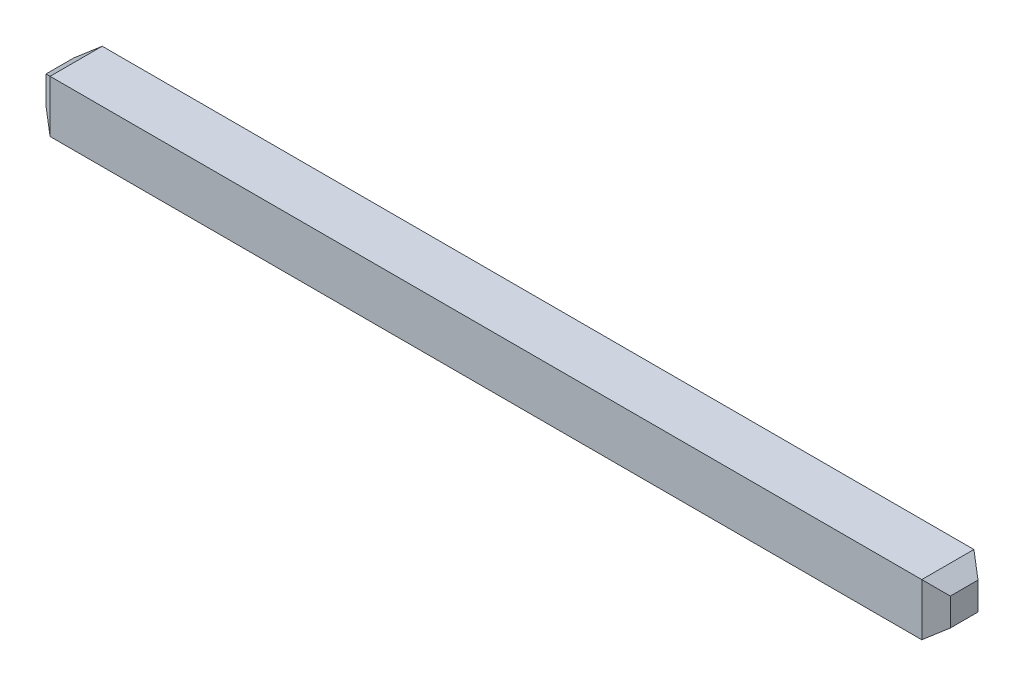
ISO-10303-21;
HEADER;
FILE_DESCRIPTION(('STEP AP214'),'2;1');
FILE_NAME('part.step','',(''),(''),'','','');
FILE_SCHEMA(('AUTOMOTIVE_DESIGN { 1 0 10303 214 1 1 1 1 }'));
ENDSEC;
DATA;
#1=APPLICATION_CONTEXT('core data for automotive mechanical design processes');
#2=APPLICATION_PROTOCOL_DEFINITION('international standard','automotive_design',2000,#1);
#3=PRODUCT_CONTEXT('',#1,'mechanical');
#4=PRODUCT('Part','Part','',(#3));
#5=PRODUCT_RELATED_PRODUCT_CATEGORY('part','',(#4));
#6=PRODUCT_DEFINITION_FORMATION('','',#4);
#7=PRODUCT_DEFINITION_CONTEXT('part definition',#1,'design');
#8=PRODUCT_DEFINITION('design','',#6,#7);
#9=PRODUCT_DEFINITION_SHAPE('','',#8);
#10=(LENGTH_UNIT() NAMED_UNIT(*) SI_UNIT(.MILLI.,.METRE.));
#11=(NAMED_UNIT(*) PLANE_ANGLE_UNIT() SI_UNIT($,.RADIAN.));
#12=(NAMED_UNIT(*) SI_UNIT($,.STERADIAN.) SOLID_ANGLE_UNIT());
#13=UNCERTAINTY_MEASURE_WITH_UNIT(LENGTH_MEASURE(1.E-05),#10,'distance_accuracy_value','');
#14=(GEOMETRIC_REPRESENTATION_CONTEXT(3) GLOBAL_UNCERTAINTY_ASSIGNED_CONTEXT((#13)) GLOBAL_UNIT_ASSIGNED_CONTEXT((#10,
#11,#12)) REPRESENTATION_CONTEXT('',''));
#15=CARTESIAN_POINT('',(0.,0.,0.));
#16=DIRECTION('',(0.,0.,1.));
#17=DIRECTION('',(1.,0.,0.));
#18=AXIS2_PLACEMENT_3D('',#15,#16,#17);
#19=CARTESIAN_POINT('',(-2.4,3.525,-31.75));
#20=DIRECTION('',(0.6,0.8,0.));
#21=DIRECTION('',(-0.8,0.6,0.));
#22=AXIS2_PLACEMENT_3D('',#19,#20,#21);
#23=PLANE('',#22);
#24=DIRECTION('',(0.,0.,1.));
#25=VECTOR('',#24,1.);
#26=CARTESIAN_POINT('',(-2.3,3.45,-31.75));
#27=LINE('',#26,#25);
#28=CARTESIAN_POINT('',(-2.29999999999978,3.45,-32.0699999999997));
#29=VERTEX_POINT('',#28);
#30=CARTESIAN_POINT('',(-2.29999999999978,3.45,-31.4300000000003));
#31=VERTEX_POINT('',#30);
#32=EDGE_CURVE('E105',#29,#31,#27,.T.);
#33=ORIENTED_EDGE('',*,*,#32,.T.);
#34=DIRECTION('',(0.685994340575952,-0.514495755427537,0.514495755419627));
#35=VECTOR('',#34,1.);
#36=CARTESIAN_POINT('',(-2.50000000000086,3.6,-31.5799999999988));
#37=LINE('',#36,#35);
#38=CARTESIAN_POINT('',(-2.50000000000021,3.6,-31.5799999999997));
#39=VERTEX_POINT('',#38);
#40=EDGE_CURVE('E92',#39,#31,#37,.T.);
#41=ORIENTED_EDGE('',*,*,#40,.F.);
#42=DIRECTION('',(0.,0.,-1.));
#43=VECTOR('',#42,1.);
#44=CARTESIAN_POINT('',(-2.5,3.6,-31.75));
#45=LINE('',#44,#43);
#46=CARTESIAN_POINT('',(-2.50000000000043,3.6,-31.9200000000006));
#47=VERTEX_POINT('',#46);
#48=EDGE_CURVE('E79',#39,#47,#45,.T.);
#49=ORIENTED_EDGE('',*,*,#48,.T.);
#50=DIRECTION('',(0.685994340575993,-0.514495755427534,-0.514495755419576));
#51=VECTOR('',#50,1.);
#52=CARTESIAN_POINT('',(-2.50000000000087,3.6,-31.9200000000012));
#53=LINE('',#52,#51);
#54=EDGE_CURVE('E20',#47,#29,#53,.T.);
#55=ORIENTED_EDGE('',*,*,#54,.T.);
#56=EDGE_LOOP('',(#33,#41,#49,#55));
#57=FACE_BOUND('',#56,.T.);
#58=ADVANCED_FACE('F17',(#57),#23,.F.);
#59=CARTESIAN_POINT('',(8.5,3.525,-31.75));
#60=DIRECTION('',(-0.6,0.8,0.));
#61=DIRECTION('',(-0.8,-0.6,0.));
#62=AXIS2_PLACEMENT_3D('',#59,#60,#61);
#63=PLANE('',#62);
#64=DIRECTION('',(0.,0.,-1.));
#65=VECTOR('',#64,1.);
#66=CARTESIAN_POINT('',(8.6,3.6,-31.75));
#67=LINE('',#66,#65);
#68=CARTESIAN_POINT('',(8.60000000000043,3.6,-31.5799999999994));
#69=VERTEX_POINT('',#68);
#70=CARTESIAN_POINT('',(8.60000000000022,3.6,-31.9200000000003));
#71=VERTEX_POINT('',#70);
#72=EDGE_CURVE('E114',#69,#71,#67,.T.);
#73=ORIENTED_EDGE('',*,*,#72,.F.);
#74=DIRECTION('',(0.68599434057595,0.514495755427539,-0.514495755419628));
#75=VECTOR('',#74,1.);
#76=CARTESIAN_POINT('',(8.39999999999914,3.45,-31.4300000000012));
#77=LINE('',#76,#75);
#78=CARTESIAN_POINT('',(8.39999999999989,3.45,-31.4300000000001));
#79=VERTEX_POINT('',#78);
#80=EDGE_CURVE('E109',#79,#69,#77,.T.);
#81=ORIENTED_EDGE('',*,*,#80,.F.);
#82=DIRECTION('',(0.,0.,1.));
#83=VECTOR('',#82,1.);
#84=CARTESIAN_POINT('',(8.4,3.45,-31.75));
#85=LINE('',#84,#83);
#86=CARTESIAN_POINT('',(8.39999999999978,3.45,-32.0699999999997));
#87=VERTEX_POINT('',#86);
#88=EDGE_CURVE('E103',#79,#87,#85,.F.);
#89=ORIENTED_EDGE('',*,*,#88,.T.);
#90=DIRECTION('',(0.685994340575992,0.514495755427534,0.514495755419576));
#91=VECTOR('',#90,1.);
#92=CARTESIAN_POINT('',(8.39999999999913,3.45,-32.0699999999988));
#93=LINE('',#92,#91);
#94=EDGE_CURVE('E107',#87,#71,#93,.T.);
#95=ORIENTED_EDGE('',*,*,#94,.T.);
#96=EDGE_LOOP('',(#73,#81,#89,#95));
#97=FACE_BOUND('',#96,.T.);
#98=ADVANCED_FACE('F175',(#97),#63,.F.);
#99=CARTESIAN_POINT('',(-2.4,3.77,-31.995));
#100=DIRECTION('',(0.599999999990736,0.,0.800000000006948));
#101=DIRECTION('',(0.800000000006948,0.,-0.599999999990736));
#102=AXIS2_PLACEMENT_3D('',#99,#100,#101);
#103=PLANE('',#102);
#104=DIRECTION('',(0.,1.,0.));
#105=VECTOR('',#104,1.);
#106=CARTESIAN_POINT('',(-2.3,3.77,-32.07));
#107=LINE('',#106,#105);
#108=CARTESIAN_POINT('',(-2.29999999999957,4.09,-32.0699999999994));
#109=VERTEX_POINT('',#108);
#110=EDGE_CURVE('E88',#109,#29,#107,.F.);
#111=ORIENTED_EDGE('',*,*,#110,.T.);
#112=ORIENTED_EDGE('',*,*,#54,.F.);
#113=DIRECTION('',(0.,1.,0.));
#114=VECTOR('',#113,1.);
#115=CARTESIAN_POINT('',(-2.5,3.77,-31.92));
#116=LINE('',#115,#114);
#117=CARTESIAN_POINT('',(-2.50000000000043,3.94,-31.9200000000006));
#118=VERTEX_POINT('',#117);
#119=EDGE_CURVE('E85',#47,#118,#116,.T.);
#120=ORIENTED_EDGE('',*,*,#119,.T.);
#121=DIRECTION('',(-0.685994340570039,-0.514495755427529,0.51449575542752));
#122=VECTOR('',#121,1.);
#123=CARTESIAN_POINT('',(-2.3,4.09,-32.07));
#124=LINE('',#123,#122);
#125=EDGE_CURVE('E126',#109,#118,#124,.T.);
#126=ORIENTED_EDGE('',*,*,#125,.F.);
#127=EDGE_LOOP('',(#111,#112,#120,#126));
#128=FACE_BOUND('',#127,.T.);
#129=ADVANCED_FACE('F84',(#128),#103,.F.);
#130=CARTESIAN_POINT('',(-2.5,3.77,-31.75));
#131=DIRECTION('',(1.,0.,0.));
#132=DIRECTION('',(0.,0.,-1.));
#133=AXIS2_PLACEMENT_3D('',#130,#131,#132);
#134=PLANE('',#133);
#135=DIRECTION('',(0.,1.,0.));
#136=VECTOR('',#135,1.);
#137=CARTESIAN_POINT('',(-2.50000000000086,3.77,-31.5799999999988));
#138=LINE('',#137,#136);
#139=CARTESIAN_POINT('',(-2.50000000000021,3.94,-31.5799999999997));
#140=VERTEX_POINT('',#139);
#141=EDGE_CURVE('E94',#140,#39,#138,.F.);
#142=ORIENTED_EDGE('',*,*,#141,.F.);
#143=DIRECTION('',(0.,0.,1.));
#144=VECTOR('',#143,1.);
#145=CARTESIAN_POINT('',(-2.5,3.94,-31.75));
#146=LINE('',#145,#144);
#147=EDGE_CURVE('E98',#118,#140,#146,.T.);
#148=ORIENTED_EDGE('',*,*,#147,.F.);
#149=ORIENTED_EDGE('',*,*,#119,.F.);
#150=ORIENTED_EDGE('',*,*,#48,.F.);
#151=EDGE_LOOP('',(#142,#148,#149,#150));
#152=FACE_BOUND('',#151,.T.);
#153=ADVANCED_FACE('F96',(#152),#134,.F.);
#154=CARTESIAN_POINT('',(-2.4,3.77,-31.505));
#155=DIRECTION('',(-0.5999999999908,0.,0.8000000000069));
#156=DIRECTION('',(0.8000000000069,0.,0.5999999999908));
#157=AXIS2_PLACEMENT_3D('',#154,#155,#156);
#158=PLANE('',#157);
#159=ORIENTED_EDGE('',*,*,#40,.T.);
#160=DIRECTION('',(0.,1.,0.));
#161=VECTOR('',#160,1.);
#162=CARTESIAN_POINT('',(-2.3,3.77,-31.43));
#163=LINE('',#162,#161);
#164=CARTESIAN_POINT('',(-2.29999999999957,4.09,-31.4300000000006));
#165=VERTEX_POINT('',#164);
#166=EDGE_CURVE('E132',#165,#31,#163,.F.);
#167=ORIENTED_EDGE('',*,*,#166,.F.);
#168=DIRECTION('',(0.685994340570039,0.514495755427529,0.51449575542752));
#169=VECTOR('',#168,1.);
#170=CARTESIAN_POINT('',(-2.5,3.94,-31.58));
#171=LINE('',#170,#169);
#172=EDGE_CURVE('E129',#140,#165,#171,.T.);
#173=ORIENTED_EDGE('',*,*,#172,.F.);
#174=ORIENTED_EDGE('',*,*,#141,.T.);
#175=EDGE_LOOP('',(#159,#167,#173,#174));
#176=FACE_BOUND('',#175,.T.);
#177=ADVANCED_FACE('F186',(#176),#158,.T.);
#178=CARTESIAN_POINT('',(3.05,3.45,-31.75));
#179=DIRECTION('',(0.,1.,0.));
#180=DIRECTION('',(0.,0.,1.));
#181=AXIS2_PLACEMENT_3D('',#178,#179,#180);
#182=PLANE('',#181);
#183=ORIENTED_EDGE('',*,*,#32,.F.);
#184=DIRECTION('',(1.,0.,0.));
#185=VECTOR('',#184,1.);
#186=CARTESIAN_POINT('',(3.05,3.45,-32.07));
#187=LINE('',#186,#185);
#188=EDGE_CURVE('E123',#29,#87,#187,.T.);
#189=ORIENTED_EDGE('',*,*,#188,.T.);
#190=ORIENTED_EDGE('',*,*,#88,.F.);
#191=DIRECTION('',(1.,0.,0.));
#192=VECTOR('',#191,1.);
#193=CARTESIAN_POINT('',(3.05,3.45,-31.43));
#194=LINE('',#193,#192);
#195=EDGE_CURVE('E135',#31,#79,#194,.T.);
#196=ORIENTED_EDGE('',*,*,#195,.F.);
#197=EDGE_LOOP('',(#183,#189,#190,#196));
#198=FACE_BOUND('',#197,.T.);
#199=ADVANCED_FACE('F179',(#198),#182,.F.);
#200=CARTESIAN_POINT('',(8.5,3.77,-31.995));
#201=DIRECTION('',(-0.599999999990736,0.,0.800000000006948));
#202=DIRECTION('',(0.800000000006948,0.,0.599999999990736));
#203=AXIS2_PLACEMENT_3D('',#200,#201,#202);
#204=PLANE('',#203);
#205=DIRECTION('',(0.,1.,0.));
#206=VECTOR('',#205,1.);
#207=CARTESIAN_POINT('',(8.6,3.77,-31.92));
#208=LINE('',#207,#206);
#209=CARTESIAN_POINT('',(8.60000000000043,3.94,-31.9200000000006));
#210=VERTEX_POINT('',#209);
#211=EDGE_CURVE('E117',#71,#210,#208,.T.);
#212=ORIENTED_EDGE('',*,*,#211,.F.);
#213=ORIENTED_EDGE('',*,*,#94,.F.);
#214=DIRECTION('',(0.,1.,0.));
#215=VECTOR('',#214,1.);
#216=CARTESIAN_POINT('',(8.4,3.77,-32.07));
#217=LINE('',#216,#215);
#218=CARTESIAN_POINT('',(8.39999999999957,4.09,-32.0699999999994));
#219=VERTEX_POINT('',#218);
#220=EDGE_CURVE('E120',#87,#219,#217,.T.);
#221=ORIENTED_EDGE('',*,*,#220,.T.);
#222=DIRECTION('',(-0.685994340570037,0.514495755427528,-0.514495755427522));
#223=VECTOR('',#222,1.);
#224=CARTESIAN_POINT('',(8.6,3.94,-31.92));
#225=LINE('',#224,#223);
#226=EDGE_CURVE('E140',#210,#219,#225,.T.);
#227=ORIENTED_EDGE('',*,*,#226,.F.);
#228=EDGE_LOOP('',(#212,#213,#221,#227));
#229=FACE_BOUND('',#228,.T.);
#230=ADVANCED_FACE('F167',(#229),#204,.F.);
#231=CARTESIAN_POINT('',(8.5,3.77,-31.505));
#232=DIRECTION('',(0.5999999999908,0.,0.8000000000069));
#233=DIRECTION('',(0.8000000000069,0.,-0.5999999999908));
#234=AXIS2_PLACEMENT_3D('',#231,#232,#233);
#235=PLANE('',#234);
#236=DIRECTION('',(0.685994340570037,-0.514495755427528,-0.514495755427522));
#237=VECTOR('',#236,1.);
#238=CARTESIAN_POINT('',(8.4,4.09,-31.43));
#239=LINE('',#238,#237);
#240=CARTESIAN_POINT('',(8.39999999999957,4.09,-31.4300000000006));
#241=VERTEX_POINT('',#240);
#242=CARTESIAN_POINT('',(8.60000000000043,3.94,-31.5799999999994));
#243=VERTEX_POINT('',#242);
#244=EDGE_CURVE('E35',#241,#243,#239,.T.);
#245=ORIENTED_EDGE('',*,*,#244,.F.);
#246=DIRECTION('',(0.,1.,0.));
#247=VECTOR('',#246,1.);
#248=CARTESIAN_POINT('',(8.4,3.77,-31.43));
#249=LINE('',#248,#247);
#250=EDGE_CURVE('E138',#79,#241,#249,.T.);
#251=ORIENTED_EDGE('',*,*,#250,.F.);
#252=ORIENTED_EDGE('',*,*,#80,.T.);
#253=DIRECTION('',(0.,1.,0.));
#254=VECTOR('',#253,1.);
#255=CARTESIAN_POINT('',(8.6,3.77,-31.58));
#256=LINE('',#255,#254);
#257=EDGE_CURVE('E111',#243,#69,#256,.F.);
#258=ORIENTED_EDGE('',*,*,#257,.F.);
#259=EDGE_LOOP('',(#245,#251,#252,#258));
#260=FACE_BOUND('',#259,.T.);
#261=ADVANCED_FACE('F211',(#260),#235,.T.);
#262=CARTESIAN_POINT('',(8.6,3.77,-31.75));
#263=DIRECTION('',(1.,0.,0.));
#264=DIRECTION('',(0.,0.,-1.));
#265=AXIS2_PLACEMENT_3D('',#262,#263,#264);
#266=PLANE('',#265);
#267=ORIENTED_EDGE('',*,*,#211,.T.);
#268=DIRECTION('',(0.,0.,1.));
#269=VECTOR('',#268,1.);
#270=CARTESIAN_POINT('',(8.6,3.94,-31.75));
#271=LINE('',#270,#269);
#272=EDGE_CURVE('E144',#243,#210,#271,.F.);
#273=ORIENTED_EDGE('',*,*,#272,.F.);
#274=ORIENTED_EDGE('',*,*,#257,.T.);
#275=ORIENTED_EDGE('',*,*,#72,.T.);
#276=EDGE_LOOP('',(#267,#273,#274,#275));
#277=FACE_BOUND('',#276,.T.);
#278=ADVANCED_FACE('F172',(#277),#266,.T.);
#279=CARTESIAN_POINT('',(3.05,3.77,-32.07));
#280=DIRECTION('',(0.,0.,1.));
#281=DIRECTION('',(1.,0.,0.));
#282=AXIS2_PLACEMENT_3D('',#279,#280,#281);
#283=PLANE('',#282);
#284=ORIENTED_EDGE('',*,*,#110,.F.);
#285=DIRECTION('',(1.,0.,0.));
#286=VECTOR('',#285,1.);
#287=CARTESIAN_POINT('',(3.05,4.09,-32.07));
#288=LINE('',#287,#286);
#289=EDGE_CURVE('E147',#219,#109,#288,.F.);
#290=ORIENTED_EDGE('',*,*,#289,.F.);
#291=ORIENTED_EDGE('',*,*,#220,.F.);
#292=ORIENTED_EDGE('',*,*,#188,.F.);
#293=EDGE_LOOP('',(#284,#290,#291,#292));
#294=FACE_BOUND('',#293,.T.);
#295=ADVANCED_FACE('F181',(#294),#283,.F.);
#296=CARTESIAN_POINT('',(-2.4,4.015,-31.75));
#297=DIRECTION('',(-0.6,0.8,0.));
#298=DIRECTION('',(-0.8,-0.6,0.));
#299=AXIS2_PLACEMENT_3D('',#296,#297,#298);
#300=PLANE('',#299);
#301=ORIENTED_EDGE('',*,*,#172,.T.);
#302=DIRECTION('',(0.,0.,1.));
#303=VECTOR('',#302,1.);
#304=CARTESIAN_POINT('',(-2.3,4.09,-31.75));
#305=LINE('',#304,#303);
#306=EDGE_CURVE('E150',#109,#165,#305,.T.);
#307=ORIENTED_EDGE('',*,*,#306,.F.);
#308=ORIENTED_EDGE('',*,*,#125,.T.);
#309=ORIENTED_EDGE('',*,*,#147,.T.);
#310=EDGE_LOOP('',(#301,#307,#308,#309));
#311=FACE_BOUND('',#310,.T.);
#312=ADVANCED_FACE('F183',(#311),#300,.T.);
#313=CARTESIAN_POINT('',(3.05,3.77,-31.43));
#314=DIRECTION('',(0.,0.,1.));
#315=DIRECTION('',(1.,0.,0.));
#316=AXIS2_PLACEMENT_3D('',#313,#314,#315);
#317=PLANE('',#316);
#318=ORIENTED_EDGE('',*,*,#195,.T.);
#319=ORIENTED_EDGE('',*,*,#250,.T.);
#320=DIRECTION('',(1.,0.,0.));
#321=VECTOR('',#320,1.);
#322=CARTESIAN_POINT('',(3.05,4.09,-31.43));
#323=LINE('',#322,#321);
#324=EDGE_CURVE('E26',#165,#241,#323,.T.);
#325=ORIENTED_EDGE('',*,*,#324,.F.);
#326=ORIENTED_EDGE('',*,*,#166,.T.);
#327=EDGE_LOOP('',(#318,#319,#325,#326));
#328=FACE_BOUND('',#327,.T.);
#329=ADVANCED_FACE('F160',(#328),#317,.T.);
#330=CARTESIAN_POINT('',(8.5,4.015,-31.75));
#331=DIRECTION('',(0.6,0.8,0.));
#332=DIRECTION('',(-0.8,0.6,0.));
#333=AXIS2_PLACEMENT_3D('',#330,#331,#332);
#334=PLANE('',#333);
#335=ORIENTED_EDGE('',*,*,#244,.T.);
#336=ORIENTED_EDGE('',*,*,#272,.T.);
#337=ORIENTED_EDGE('',*,*,#226,.T.);
#338=DIRECTION('',(0.,0.,1.));
#339=VECTOR('',#338,1.);
#340=CARTESIAN_POINT('',(8.4,4.09,-31.75));
#341=LINE('',#340,#339);
#342=EDGE_CURVE('E11',#241,#219,#341,.F.);
#343=ORIENTED_EDGE('',*,*,#342,.F.);
#344=EDGE_LOOP('',(#335,#336,#337,#343));
#345=FACE_BOUND('',#344,.T.);
#346=ADVANCED_FACE('F163',(#345),#334,.T.);
#347=CARTESIAN_POINT('',(3.05,4.09,-31.75));
#348=DIRECTION('',(0.,1.,0.));
#349=DIRECTION('',(0.,0.,1.));
#350=AXIS2_PLACEMENT_3D('',#347,#348,#349);
#351=PLANE('',#350);
#352=ORIENTED_EDGE('',*,*,#324,.T.);
#353=ORIENTED_EDGE('',*,*,#342,.T.);
#354=ORIENTED_EDGE('',*,*,#289,.T.);
#355=ORIENTED_EDGE('',*,*,#306,.T.);
#356=EDGE_LOOP('',(#352,#353,#354,#355));
#357=FACE_BOUND('',#356,.T.);
#358=ADVANCED_FACE('F156',(#357),#351,.T.);
#359=CLOSED_SHELL('',(#58,#98,#129,#153,#177,#199,#230,#261,#278,#295,#312,#329,#346,#358));
#360=MANIFOLD_SOLID_BREP('B1',#359);
#361=ADVANCED_BREP_SHAPE_REPRESENTATION('',(#18,#360),#14);
#362=SHAPE_DEFINITION_REPRESENTATION(#9,#361);
ENDSEC;
END-ISO-10303-21;
